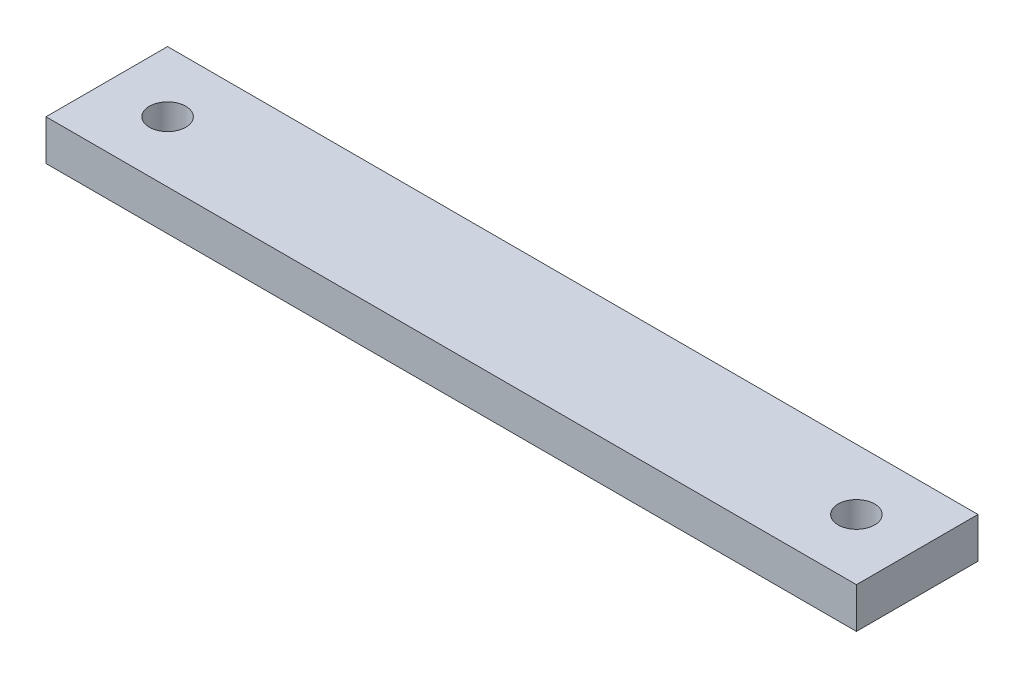
ISO-10303-21;
HEADER;
FILE_DESCRIPTION(('STEP AP214'),'2;1');
FILE_NAME('part.step','',(''),(''),'','','');
FILE_SCHEMA(('AUTOMOTIVE_DESIGN { 1 0 10303 214 1 1 1 1 }'));
ENDSEC;
DATA;
#1=APPLICATION_CONTEXT('core data for automotive mechanical design processes');
#2=APPLICATION_PROTOCOL_DEFINITION('international standard','automotive_design',2000,#1);
#3=PRODUCT_CONTEXT('',#1,'mechanical');
#4=PRODUCT('Part','Part','',(#3));
#5=PRODUCT_RELATED_PRODUCT_CATEGORY('part','',(#4));
#6=PRODUCT_DEFINITION_FORMATION('','',#4);
#7=PRODUCT_DEFINITION_CONTEXT('part definition',#1,'design');
#8=PRODUCT_DEFINITION('design','',#6,#7);
#9=PRODUCT_DEFINITION_SHAPE('','',#8);
#10=(LENGTH_UNIT() NAMED_UNIT(*) SI_UNIT(.MILLI.,.METRE.));
#11=(NAMED_UNIT(*) PLANE_ANGLE_UNIT() SI_UNIT($,.RADIAN.));
#12=(NAMED_UNIT(*) SI_UNIT($,.STERADIAN.) SOLID_ANGLE_UNIT());
#13=UNCERTAINTY_MEASURE_WITH_UNIT(LENGTH_MEASURE(1.E-05),#10,'distance_accuracy_value','');
#14=(GEOMETRIC_REPRESENTATION_CONTEXT(3) GLOBAL_UNCERTAINTY_ASSIGNED_CONTEXT((#13)) GLOBAL_UNIT_ASSIGNED_CONTEXT((#10,
#11,#12)) REPRESENTATION_CONTEXT('',''));
#15=CARTESIAN_POINT('',(0.,0.,0.));
#16=DIRECTION('',(0.,0.,1.));
#17=DIRECTION('',(1.,0.,0.));
#18=AXIS2_PLACEMENT_3D('',#15,#16,#17);
#19=CARTESIAN_POINT('',(0.,10.,0.));
#20=DIRECTION('',(0.,-1.,0.));
#21=DIRECTION('',(0.,0.,-1.));
#22=AXIS2_PLACEMENT_3D('',#19,#20,#21);
#23=PLANE('',#22);
#24=DIRECTION('',(0.,0.,-1.));
#25=VECTOR('',#24,1.);
#26=CARTESIAN_POINT('',(0.,10.,-30.));
#27=LINE('',#26,#25);
#28=CARTESIAN_POINT('',(0.,10.,0.));
#29=VERTEX_POINT('',#28);
#30=CARTESIAN_POINT('',(0.,10.,-30.));
#31=VERTEX_POINT('',#30);
#32=EDGE_CURVE('E88',#29,#31,#27,.T.);
#33=ORIENTED_EDGE('',*,*,#32,.T.);
#34=DIRECTION('',(-1.,0.,0.));
#35=VECTOR('',#34,1.);
#36=CARTESIAN_POINT('',(-200.,10.,-30.));
#37=LINE('',#36,#35);
#38=CARTESIAN_POINT('',(-200.,10.,-30.));
#39=VERTEX_POINT('',#38);
#40=EDGE_CURVE('E83',#31,#39,#37,.T.);
#41=ORIENTED_EDGE('',*,*,#40,.T.);
#42=DIRECTION('',(0.,0.,1.));
#43=VECTOR('',#42,1.);
#44=CARTESIAN_POINT('',(-200.,10.,0.));
#45=LINE('',#44,#43);
#46=CARTESIAN_POINT('',(-200.,10.,0.));
#47=VERTEX_POINT('',#46);
#48=EDGE_CURVE('E86',#39,#47,#45,.T.);
#49=ORIENTED_EDGE('',*,*,#48,.T.);
#50=DIRECTION('',(1.,0.,0.));
#51=VECTOR('',#50,1.);
#52=CARTESIAN_POINT('',(0.,10.,0.));
#53=LINE('',#52,#51);
#54=EDGE_CURVE('E53',#47,#29,#53,.T.);
#55=ORIENTED_EDGE('',*,*,#54,.T.);
#56=EDGE_LOOP('',(#33,#41,#49,#55));
#57=FACE_BOUND('',#56,.T.);
#58=CARTESIAN_POINT('',(-185.,10.,-15.));
#59=DIRECTION('',(0.,1.,0.));
#60=DIRECTION('',(0.,0.,1.));
#61=AXIS2_PLACEMENT_3D('',#58,#59,#60);
#62=CIRCLE('',#61,4.49999999999999);
#63=CARTESIAN_POINT('',(-185.,10.,-10.5));
#64=VERTEX_POINT('',#63);
#65=EDGE_CURVE('E103',#64,#64,#62,.T.);
#66=ORIENTED_EDGE('',*,*,#65,.F.);
#67=EDGE_LOOP('',(#66));
#68=FACE_BOUND('',#67,.T.);
#69=CARTESIAN_POINT('',(-15.,10.,-15.));
#70=DIRECTION('',(0.,1.,0.));
#71=DIRECTION('',(0.,0.,1.));
#72=AXIS2_PLACEMENT_3D('',#69,#70,#71);
#73=CIRCLE('',#72,4.5);
#74=CARTESIAN_POINT('',(-15.,10.,-10.5));
#75=VERTEX_POINT('',#74);
#76=EDGE_CURVE('E118',#75,#75,#73,.T.);
#77=ORIENTED_EDGE('',*,*,#76,.F.);
#78=EDGE_LOOP('',(#77));
#79=FACE_BOUND('',#78,.T.);
#80=ADVANCED_FACE('F36',(#57,#68,#79),#23,.F.);
#81=CARTESIAN_POINT('',(0.,0.,0.));
#82=DIRECTION('',(0.,-1.,0.));
#83=DIRECTION('',(0.,0.,-1.));
#84=AXIS2_PLACEMENT_3D('',#81,#82,#83);
#85=PLANE('',#84);
#86=CARTESIAN_POINT('',(-185.,0.,-15.));
#87=DIRECTION('',(0.,1.,0.));
#88=DIRECTION('',(0.,0.,1.));
#89=AXIS2_PLACEMENT_3D('',#86,#87,#88);
#90=CIRCLE('',#89,4.49999999999999);
#91=CARTESIAN_POINT('',(-185.,0.,-10.5));
#92=VERTEX_POINT('',#91);
#93=EDGE_CURVE('E115',#92,#92,#90,.T.);
#94=ORIENTED_EDGE('',*,*,#93,.T.);
#95=EDGE_LOOP('',(#94));
#96=FACE_BOUND('',#95,.T.);
#97=DIRECTION('',(0.,0.,-1.));
#98=VECTOR('',#97,1.);
#99=CARTESIAN_POINT('',(0.,0.,-30.));
#100=LINE('',#99,#98);
#101=CARTESIAN_POINT('',(0.,0.,0.));
#102=VERTEX_POINT('',#101);
#103=CARTESIAN_POINT('',(0.,0.,-30.));
#104=VERTEX_POINT('',#103);
#105=EDGE_CURVE('E100',#102,#104,#100,.T.);
#106=ORIENTED_EDGE('',*,*,#105,.F.);
#107=DIRECTION('',(1.,0.,0.));
#108=VECTOR('',#107,1.);
#109=CARTESIAN_POINT('',(0.,0.,0.));
#110=LINE('',#109,#108);
#111=CARTESIAN_POINT('',(-200.,0.,0.));
#112=VERTEX_POINT('',#111);
#113=EDGE_CURVE('E76',#112,#102,#110,.T.);
#114=ORIENTED_EDGE('',*,*,#113,.F.);
#115=DIRECTION('',(0.,0.,1.));
#116=VECTOR('',#115,1.);
#117=CARTESIAN_POINT('',(-200.,0.,0.));
#118=LINE('',#117,#116);
#119=CARTESIAN_POINT('',(-200.,0.,-30.));
#120=VERTEX_POINT('',#119);
#121=EDGE_CURVE('E70',#120,#112,#118,.T.);
#122=ORIENTED_EDGE('',*,*,#121,.F.);
#123=DIRECTION('',(-1.,0.,0.));
#124=VECTOR('',#123,1.);
#125=CARTESIAN_POINT('',(-200.,0.,-30.));
#126=LINE('',#125,#124);
#127=EDGE_CURVE('E92',#104,#120,#126,.T.);
#128=ORIENTED_EDGE('',*,*,#127,.F.);
#129=EDGE_LOOP('',(#106,#114,#122,#128));
#130=FACE_BOUND('',#129,.T.);
#131=CARTESIAN_POINT('',(-15.,0.,-15.));
#132=DIRECTION('',(0.,1.,0.));
#133=DIRECTION('',(0.,0.,1.));
#134=AXIS2_PLACEMENT_3D('',#131,#132,#133);
#135=CIRCLE('',#134,4.5);
#136=CARTESIAN_POINT('',(-15.,0.,-10.5));
#137=VERTEX_POINT('',#136);
#138=EDGE_CURVE('E121',#137,#137,#135,.T.);
#139=ORIENTED_EDGE('',*,*,#138,.T.);
#140=EDGE_LOOP('',(#139));
#141=FACE_BOUND('',#140,.T.);
#142=ADVANCED_FACE('F111',(#96,#130,#141),#85,.T.);
#143=CARTESIAN_POINT('',(0.,10.,-30.));
#144=DIRECTION('',(-1.,0.,0.));
#145=DIRECTION('',(0.,0.,1.));
#146=AXIS2_PLACEMENT_3D('',#143,#144,#145);
#147=PLANE('',#146);
#148=ORIENTED_EDGE('',*,*,#105,.T.);
#149=DIRECTION('',(0.,-1.,0.));
#150=VECTOR('',#149,1.);
#151=CARTESIAN_POINT('',(0.,10.,-30.));
#152=LINE('',#151,#150);
#153=EDGE_CURVE('E11',#31,#104,#152,.T.);
#154=ORIENTED_EDGE('',*,*,#153,.F.);
#155=ORIENTED_EDGE('',*,*,#32,.F.);
#156=DIRECTION('',(0.,-1.,0.));
#157=VECTOR('',#156,1.);
#158=CARTESIAN_POINT('',(0.,10.,0.));
#159=LINE('',#158,#157);
#160=EDGE_CURVE('E96',#29,#102,#159,.T.);
#161=ORIENTED_EDGE('',*,*,#160,.T.);
#162=EDGE_LOOP('',(#148,#154,#155,#161));
#163=FACE_BOUND('',#162,.T.);
#164=ADVANCED_FACE('F38',(#163),#147,.F.);
#165=CARTESIAN_POINT('',(-200.,10.,-30.));
#166=DIRECTION('',(0.,0.,1.));
#167=DIRECTION('',(1.,0.,0.));
#168=AXIS2_PLACEMENT_3D('',#165,#166,#167);
#169=PLANE('',#168);
#170=ORIENTED_EDGE('',*,*,#127,.T.);
#171=DIRECTION('',(0.,-1.,0.));
#172=VECTOR('',#171,1.);
#173=CARTESIAN_POINT('',(-200.,10.,-30.));
#174=LINE('',#173,#172);
#175=EDGE_CURVE('E45',#39,#120,#174,.T.);
#176=ORIENTED_EDGE('',*,*,#175,.F.);
#177=ORIENTED_EDGE('',*,*,#40,.F.);
#178=ORIENTED_EDGE('',*,*,#153,.T.);
#179=EDGE_LOOP('',(#170,#176,#177,#178));
#180=FACE_BOUND('',#179,.T.);
#181=ADVANCED_FACE('F91',(#180),#169,.F.);
#182=CARTESIAN_POINT('',(-200.,10.,0.));
#183=DIRECTION('',(1.,0.,0.));
#184=DIRECTION('',(0.,0.,-1.));
#185=AXIS2_PLACEMENT_3D('',#182,#183,#184);
#186=PLANE('',#185);
#187=ORIENTED_EDGE('',*,*,#121,.T.);
#188=DIRECTION('',(0.,-1.,0.));
#189=VECTOR('',#188,1.);
#190=CARTESIAN_POINT('',(-200.,10.,0.));
#191=LINE('',#190,#189);
#192=EDGE_CURVE('E93',#47,#112,#191,.T.);
#193=ORIENTED_EDGE('',*,*,#192,.F.);
#194=ORIENTED_EDGE('',*,*,#48,.F.);
#195=ORIENTED_EDGE('',*,*,#175,.T.);
#196=EDGE_LOOP('',(#187,#193,#194,#195));
#197=FACE_BOUND('',#196,.T.);
#198=ADVANCED_FACE('F94',(#197),#186,.F.);
#199=CARTESIAN_POINT('',(0.,10.,0.));
#200=DIRECTION('',(0.,0.,-1.));
#201=DIRECTION('',(-1.,0.,0.));
#202=AXIS2_PLACEMENT_3D('',#199,#200,#201);
#203=PLANE('',#202);
#204=ORIENTED_EDGE('',*,*,#113,.T.);
#205=ORIENTED_EDGE('',*,*,#160,.F.);
#206=ORIENTED_EDGE('',*,*,#54,.F.);
#207=ORIENTED_EDGE('',*,*,#192,.T.);
#208=EDGE_LOOP('',(#204,#205,#206,#207));
#209=FACE_BOUND('',#208,.T.);
#210=ADVANCED_FACE('F108',(#209),#203,.F.);
#211=CARTESIAN_POINT('',(-185.,10.,-15.));
#212=DIRECTION('',(0.,-1.,0.));
#213=DIRECTION('',(0.,0.,-1.));
#214=AXIS2_PLACEMENT_3D('',#211,#212,#213);
#215=CYLINDRICAL_SURFACE('',#214,4.49999999999999);
#216=ORIENTED_EDGE('',*,*,#65,.T.);
#217=EDGE_LOOP('',(#216));
#218=FACE_BOUND('',#217,.T.);
#219=ORIENTED_EDGE('',*,*,#93,.F.);
#220=EDGE_LOOP('',(#219));
#221=FACE_BOUND('',#220,.T.);
#222=ADVANCED_FACE('F138',(#218,#221),#215,.F.);
#223=CARTESIAN_POINT('',(-15.,10.,-15.));
#224=DIRECTION('',(0.,-1.,0.));
#225=DIRECTION('',(0.,0.,-1.));
#226=AXIS2_PLACEMENT_3D('',#223,#224,#225);
#227=CYLINDRICAL_SURFACE('',#226,4.5);
#228=ORIENTED_EDGE('',*,*,#76,.T.);
#229=EDGE_LOOP('',(#228));
#230=FACE_BOUND('',#229,.T.);
#231=ORIENTED_EDGE('',*,*,#138,.F.);
#232=EDGE_LOOP('',(#231));
#233=FACE_BOUND('',#232,.T.);
#234=ADVANCED_FACE('F127',(#230,#233),#227,.F.);
#235=CLOSED_SHELL('',(#80,#142,#164,#181,#198,#210,#222,#234));
#236=MANIFOLD_SOLID_BREP('B2',#235);
#237=ADVANCED_BREP_SHAPE_REPRESENTATION('',(#18,#236),#14);
#238=SHAPE_DEFINITION_REPRESENTATION(#9,#237);
ENDSEC;
END-ISO-10303-21;
